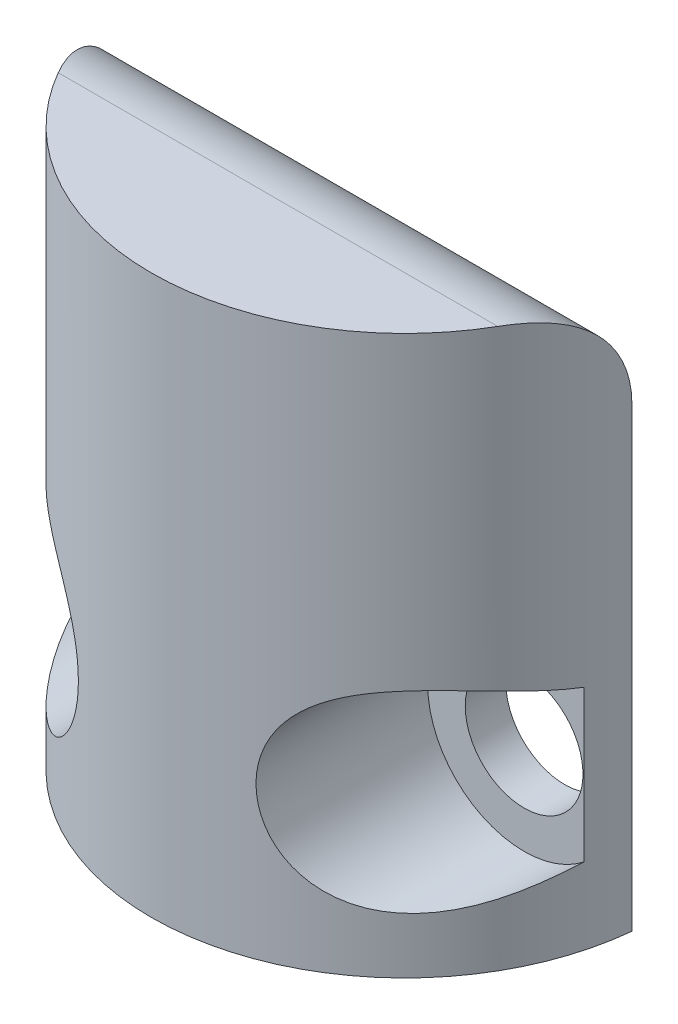
ISO-10303-21;
HEADER;
FILE_DESCRIPTION(('STEP AP214'),'2;1');
FILE_NAME('part.step','',(''),(''),'','','');
FILE_SCHEMA(('AUTOMOTIVE_DESIGN { 1 0 10303 214 1 1 1 1 }'));
ENDSEC;
DATA;
#1=APPLICATION_CONTEXT('core data for automotive mechanical design processes');
#2=APPLICATION_PROTOCOL_DEFINITION('international standard','automotive_design',2000,#1);
#3=PRODUCT_CONTEXT('',#1,'mechanical');
#4=PRODUCT('Part','Part','',(#3));
#5=PRODUCT_RELATED_PRODUCT_CATEGORY('part','',(#4));
#6=PRODUCT_DEFINITION_FORMATION('','',#4);
#7=PRODUCT_DEFINITION_CONTEXT('part definition',#1,'design');
#8=PRODUCT_DEFINITION('design','',#6,#7);
#9=PRODUCT_DEFINITION_SHAPE('','',#8);
#10=(LENGTH_UNIT() NAMED_UNIT(*) SI_UNIT(.MILLI.,.METRE.));
#11=(NAMED_UNIT(*) PLANE_ANGLE_UNIT() SI_UNIT($,.RADIAN.));
#12=(NAMED_UNIT(*) SI_UNIT($,.STERADIAN.) SOLID_ANGLE_UNIT());
#13=UNCERTAINTY_MEASURE_WITH_UNIT(LENGTH_MEASURE(1.E-05),#10,'distance_accuracy_value','');
#14=(GEOMETRIC_REPRESENTATION_CONTEXT(3) GLOBAL_UNCERTAINTY_ASSIGNED_CONTEXT((#13)) GLOBAL_UNIT_ASSIGNED_CONTEXT((#10,
#11,#12)) REPRESENTATION_CONTEXT('',''));
#15=CARTESIAN_POINT('',(0.,0.,0.));
#16=DIRECTION('',(0.,0.,1.));
#17=DIRECTION('',(1.,0.,0.));
#18=AXIS2_PLACEMENT_3D('',#15,#16,#17);
#19=CARTESIAN_POINT('',(0.,1.27,0.));
#20=DIRECTION('',(0.,-1.,0.));
#21=DIRECTION('',(0.,0.,-1.));
#22=AXIS2_PLACEMENT_3D('',#19,#20,#21);
#23=CYLINDRICAL_SURFACE('',#22,6.35);
#24=DIRECTION('',(0.,-1.,0.));
#25=VECTOR('',#24,1.);
#26=CARTESIAN_POINT('',(6.13161471392324,1.27,1.651));
#27=LINE('',#26,#25);
#28=CARTESIAN_POINT('',(6.13161471392324,-10.7832009303775,1.651));
#29=VERTEX_POINT('',#28);
#30=CARTESIAN_POINT('',(6.13161471392324,-6.99679906962246,1.651));
#31=VERTEX_POINT('',#30);
#32=EDGE_CURVE('E183',#29,#31,#27,.F.);
#33=ORIENTED_EDGE('',*,*,#32,.F.);
#34=CARTESIAN_POINT('',(6.13161471392324,-10.7832009303775,1.651));
#35=CARTESIAN_POINT('',(6.08465696292267,-10.8203372092907,1.82524408010255));
#36=CARTESIAN_POINT('',(6.03050997376315,-10.8602679103416,1.99689650970423));
#37=CARTESIAN_POINT('',(5.90784051352878,-10.9416119060905,2.33505320690604));
#38=CARTESIAN_POINT('',(5.83928842423069,-10.9830281073128,2.50154604379));
#39=CARTESIAN_POINT('',(5.68702055717028,-11.0635699656268,2.83082731543768));
#40=CARTESIAN_POINT('',(5.60311854327295,-11.1026586716354,2.99353903880474));
#41=CARTESIAN_POINT('',(5.42089611634268,-11.1736971442452,3.3121013597616));
#42=CARTESIAN_POINT('',(5.32259324440639,-11.2056554782395,3.46796000869843));
#43=CARTESIAN_POINT('',(5.09705877402021,-11.2616792393035,3.79299740181736));
#44=CARTESIAN_POINT('',(4.96770595377609,-11.2840358448012,3.96102658424538));
#45=CARTESIAN_POINT('',(4.69232277558009,-11.3062586692692,4.28359877327395));
#46=CARTESIAN_POINT('',(4.54636973762161,-11.3062252070395,4.43819883121283));
#47=CARTESIAN_POINT('',(4.27195971920654,-11.2785975424492,4.70121291922772));
#48=CARTESIAN_POINT('',(4.14588959293841,-11.2565490273376,4.81266166120411));
#49=CARTESIAN_POINT('',(3.88913196478433,-11.1884947419108,5.02239953506856));
#50=CARTESIAN_POINT('',(3.7584476141943,-11.1425050381734,5.1206974367511));
#51=CARTESIAN_POINT('',(3.52071577881404,-11.0333398417141,5.28624612254147));
#52=CARTESIAN_POINT('',(3.41342510997003,-10.9744123598844,5.35593430018937));
#53=CARTESIAN_POINT('',(3.20449564038788,-10.8368959308363,5.48349026807667));
#54=CARTESIAN_POINT('',(3.10285445770515,-10.7583153478323,5.54136306787053));
#55=CARTESIAN_POINT('',(2.90989311483558,-10.5817502943748,5.64509603090388));
#56=CARTESIAN_POINT('',(2.8186195765344,-10.4836832345985,5.69090306510827));
#57=CARTESIAN_POINT('',(2.65188822242055,-10.2706292963781,5.7704905855411));
#58=CARTESIAN_POINT('',(2.57642912727865,-10.155643787855,5.80427204474811));
#59=CARTESIAN_POINT('',(2.4505738705231,-9.92193735328656,5.85845784129009));
#60=CARTESIAN_POINT('',(2.39867685052603,-9.80421561881349,5.87970314536744));
#61=CARTESIAN_POINT('',(2.31406872354246,-9.56090033628144,5.91351648127844));
#62=CARTESIAN_POINT('',(2.2813546072585,-9.435308026334,5.9260858741912));
#63=CARTESIAN_POINT('',(2.23695652604215,-9.18268462960101,5.94298589256799));
#64=CARTESIAN_POINT('',(2.2248428857175,-9.05573998884292,5.94748495766123));
#65=CARTESIAN_POINT('',(2.22077500579655,-8.80148375915113,5.94900534751648));
#66=CARTESIAN_POINT('',(2.22882016859679,-8.67417218120698,5.94602689394794));
#67=CARTESIAN_POINT('',(2.26475051561729,-8.42285993018447,5.93243354972118));
#68=CARTESIAN_POINT('',(2.29262625879524,-8.29885771070537,5.9218222928995));
#69=CARTESIAN_POINT('',(2.36709445576711,-8.05763276974694,5.8924488606938));
#70=CARTESIAN_POINT('',(2.4136856010671,-7.94040957496504,5.87368725513681));
#71=CARTESIAN_POINT('',(2.52363191724967,-7.71603864818971,5.82729115390978));
#72=CARTESIAN_POINT('',(2.58698468215872,-7.60888947315449,5.79965793155583));
#73=CARTESIAN_POINT('',(2.72767782656088,-7.40747711140313,5.73482785768389));
#74=CARTESIAN_POINT('',(2.80501702234479,-7.31321283538789,5.69763181538081));
#75=CARTESIAN_POINT('',(2.97122847915041,-7.13857907414211,5.61276112865484));
#76=CARTESIAN_POINT('',(3.06022723505682,-7.05838862447448,5.56496685484792));
#77=CARTESIAN_POINT('',(3.24510598953764,-6.91436872559657,5.45922349889674));
#78=CARTESIAN_POINT('',(3.34098722937893,-6.85054223719006,5.40127258225523));
#79=CARTESIAN_POINT('',(3.54208855616838,-6.73563530107442,5.2717458045044));
#80=CARTESIAN_POINT('',(3.64751279157799,-6.68563774860842,5.19953362348372));
#81=CARTESIAN_POINT('',(3.85797336718289,-6.60289958274786,5.04535180954885));
#82=CARTESIAN_POINT('',(3.96300947170836,-6.57016814591338,4.96337701633228));
#83=CARTESIAN_POINT('',(4.14353329555751,-6.52634675347948,4.81287485472478));
#84=CARTESIAN_POINT('',(4.21977775052374,-6.51187752623123,4.74618736263503));
#85=CARTESIAN_POINT('',(4.36955923962279,-6.49050679831617,4.6086664621188));
#86=CARTESIAN_POINT('',(4.44309516260711,-6.48360837080112,4.53783138237688));
#87=CARTESIAN_POINT('',(4.65889022220784,-6.47281112375994,4.31960851131404));
#88=CARTESIAN_POINT('',(4.79613271549078,-6.47885399954297,4.1666726481503));
#89=CARTESIAN_POINT('',(5.02073651376534,-6.5060003963926,3.89073198991577));
#90=CARTESIAN_POINT('',(5.11182472624296,-6.52280994170981,3.77020143075632));
#91=CARTESIAN_POINT('',(5.28468359733588,-6.56426911202905,3.52381081511876));
#92=CARTESIAN_POINT('',(5.36644885750216,-6.58892324843317,3.39794772811378));
#93=CARTESIAN_POINT('',(5.52047983412565,-6.64365435257957,3.14153113017679));
#94=CARTESIAN_POINT('',(5.59273521060381,-6.67373713995497,3.01097270719764));
#95=CARTESIAN_POINT('',(5.72759728707937,-6.73699377723564,2.7457687451254));
#96=CARTESIAN_POINT('',(5.79020753766169,-6.77016648242272,2.611124731982));
#97=CARTESIAN_POINT('',(5.90468051569257,-6.83669985024577,2.34060233084139));
#98=CARTESIAN_POINT('',(5.95672713482786,-6.87004456646148,2.20479775487346));
#99=CARTESIAN_POINT('',(6.05125638615921,-6.93513504104873,1.93021526143747));
#100=CARTESIAN_POINT('',(6.09377910478681,-6.9668870474008,1.79145260568324));
#101=CARTESIAN_POINT('',(6.13161471392324,-6.99679906962246,1.651));
#102=B_SPLINE_CURVE_WITH_KNOTS('',3,(#34,#35,#36,#37,#38,#39,#40,#41,#42,#43,#44,#45,#46,#47,
#48,#49,#50,#51,#52,#53,#54,#55,#56,#57,#58,#59,#60,#61,#62,#63,#64,#65,#66,#67,#68,#69,#70,#71,
#72,#73,#74,#75,#76,#77,#78,#79,#80,#81,#82,#83,#84,#85,#86,#87,#88,#89,#90,#91,#92,#93,#94,#95,
#96,#97,#98,#99,#100,#101),.UNSPECIFIED.,.F.,.F.,(4,2,2,2,2,2,2,2,2,2,2,2,2,2,2,2,2,2,2,2,2,2,2,
2,2,2,2,2,2,2,2,2,2,4),(0.,0.552482548457462,1.10611236631593,1.66696807131099,2.22714621522914,
2.86499669254423,3.49998929712661,4.0072418450712,4.51415442132443,4.93493318785258,
5.35553317788474,5.77795534956817,6.20034333567783,6.58962445888374,6.97884449768145,
7.35984201295284,7.74082823376694,8.12163319402922,8.50241153481148,8.88313524805403,
9.26382675469244,9.64905648107823,10.034355859668,10.4444195955741,10.8547010522993,
11.1612552490851,11.467933836893,12.0820873268028,12.5375834506868,12.9933420040083,
13.4495920747905,13.9056737863644,14.3529648244433,14.7983362579525),.UNSPECIFIED.);
#103=EDGE_CURVE('E50',#29,#31,#102,.T.);
#104=ORIENTED_EDGE('',*,*,#103,.T.);
#105=EDGE_LOOP('',(#33,#104));
#106=FACE_BOUND('',#105,.T.);
#107=DIRECTION('',(0.,-1.,0.));
#108=VECTOR('',#107,1.);
#109=CARTESIAN_POINT('',(6.31817022562704,1.27,0.635));
#110=LINE('',#109,#108);
#111=CARTESIAN_POINT('',(6.31817022562704,-1.27,0.635));
#112=VERTEX_POINT('',#111);
#113=CARTESIAN_POINT('',(6.31817022562704,-12.7,0.635));
#114=VERTEX_POINT('',#113);
#115=EDGE_CURVE('E162',#112,#114,#110,.T.);
#116=ORIENTED_EDGE('',*,*,#115,.F.);
#117=CARTESIAN_POINT('',(6.31817022562704,-1.27,0.635));
#118=CARTESIAN_POINT('',(6.31816213465551,-1.1992432066637,0.634993103996943));
#119=CARTESIAN_POINT('',(6.31787284549376,-1.12848927096166,0.637956595567391));
#120=CARTESIAN_POINT('',(6.31667332253668,-0.987481066100766,0.649771301391292));
#121=CARTESIAN_POINT('',(6.31576309868674,-0.917226788957181,0.658622421343711));
#122=CARTESIAN_POINT('',(6.31326350613699,-0.777728782823313,0.68215609075237));
#123=CARTESIAN_POINT('',(6.31167432470761,-0.708484780620704,0.696837032145452));
#124=CARTESIAN_POINT('',(6.30770332879801,-0.571502021635812,0.73190634568608));
#125=CARTESIAN_POINT('',(6.305321528853,-0.503763237274785,0.752294613170233));
#126=CARTESIAN_POINT('',(6.29676691597175,-0.303431452119897,0.821856145062583));
#127=CARTESIAN_POINT('',(6.28918453090353,-0.173696930261072,0.879430567494685));
#128=CARTESIAN_POINT('',(6.2687140739029,0.0739926035038513,1.01508326199739));
#129=CARTESIAN_POINT('',(6.25582744858638,0.191950816251108,1.09315594151455));
#130=CARTESIAN_POINT('',(6.22306162554342,0.411687416460578,1.2663627895557));
#131=CARTESIAN_POINT('',(6.20325018147308,0.513609176920733,1.36132741479937));
#132=CARTESIAN_POINT('',(6.15493288844206,0.699670867381586,1.56532788801136));
#133=CARTESIAN_POINT('',(6.12643146205448,0.783819805675464,1.67435656214905));
#134=CARTESIAN_POINT('',(6.06017165885335,0.930912029696587,1.90009592462027));
#135=CARTESIAN_POINT('',(6.0226064965564,0.99424004996232,2.01661320493012));
#136=CARTESIAN_POINT('',(5.93744950044908,1.10115570756565,2.25504461676565));
#137=CARTESIAN_POINT('',(5.88984672218053,1.14472163267309,2.37696452345884));
#138=CARTESIAN_POINT('',(5.78877505207432,1.20984957430456,2.61301421922237));
#139=CARTESIAN_POINT('',(5.73599027193432,1.23278840808031,2.72706124687398));
#140=CARTESIAN_POINT('',(5.65121035022969,1.25534127515703,2.89660585776617));
#141=CARTESIAN_POINT('',(5.6220463213732,1.26088333867412,2.95281480630573));
#142=CARTESIAN_POINT('',(5.56195350236283,1.26821169516376,3.0645058550167));
#143=CARTESIAN_POINT('',(5.53102534653192,1.26999932947192,3.11998820773468));
#144=CARTESIAN_POINT('',(5.49926131403119,1.27,3.175));
#145=B_SPLINE_CURVE_WITH_KNOTS('',3,(#117,#118,#119,#120,#121,#122,#123,#124,#125,#126,#127,
#128,#129,#130,#131,#132,#133,#134,#135,#136,#137,#138,#139,#140,#141,#142,#143,#144),
.UNSPECIFIED.,.F.,.F.,(4,2,2,2,2,2,2,2,2,2,2,2,2,4),(0.,0.212202505805552,0.424401612885381,
0.636542228841824,0.848678954727564,1.27287401322298,1.69695345833858,2.11699470350588,
2.53682253384688,2.94838819045532,3.36040493751236,3.74227345320946,3.93285333693207,
4.12336512106239),.UNSPECIFIED.);
#146=CARTESIAN_POINT('',(5.49926131403119,1.27,3.175));
#147=VERTEX_POINT('',#146);
#148=EDGE_CURVE('E122',#112,#147,#145,.T.);
#149=ORIENTED_EDGE('',*,*,#148,.T.);
#150=CARTESIAN_POINT('',(0.,1.27,0.));
#151=DIRECTION('',(0.,-1.,0.));
#152=DIRECTION('',(0.,0.,-1.));
#153=AXIS2_PLACEMENT_3D('',#150,#151,#152);
#154=CIRCLE('',#153,6.35);
#155=CARTESIAN_POINT('',(-5.49926131403119,1.27,3.175));
#156=VERTEX_POINT('',#155);
#157=EDGE_CURVE('E159',#147,#156,#154,.T.);
#158=ORIENTED_EDGE('',*,*,#157,.T.);
#159=CARTESIAN_POINT('',(-5.49926131403119,1.27,3.175));
#160=CARTESIAN_POINT('',(-5.53672702267652,1.27000551953054,3.11012790358959));
#161=CARTESIAN_POINT('',(-5.57303629384351,1.26751405844095,3.0445668314749));
#162=CARTESIAN_POINT('',(-5.64317998425625,1.25726564480609,2.91248716880679));
#163=CARTESIAN_POINT('',(-5.67701277607268,1.24950526357727,2.84596798237807));
#164=CARTESIAN_POINT('',(-5.74207093839374,1.22842126657922,2.71231657017477));
#165=CARTESIAN_POINT('',(-5.7732897945984,1.21508422086392,2.64518324975682));
#166=CARTESIAN_POINT('',(-5.83287187191984,1.18266662952606,2.51107618554955));
#167=CARTESIAN_POINT('',(-5.86123572587105,1.16358736047159,2.44410240962353));
#168=CARTESIAN_POINT('',(-5.9421222191991,1.09730411344959,2.24373948339701));
#169=CARTESIAN_POINT('',(-5.99021965474208,1.04112298182265,2.11136555720538));
#170=CARTESIAN_POINT('',(-6.07434739218528,0.905210716645366,1.85552513560956));
#171=CARTESIAN_POINT('',(-6.11040008296635,0.825523801134444,1.73204245220025));
#172=CARTESIAN_POINT('',(-6.1693944038546,0.651138459608564,1.50782206664462));
#173=CARTESIAN_POINT('',(-6.1931109052655,0.557994427164414,1.40607624026618));
#174=CARTESIAN_POINT('',(-6.23276646980775,0.355473556340831,1.21834207465354));
#175=CARTESIAN_POINT('',(-6.2487011545758,0.246087624642054,1.13236262316588));
#176=CARTESIAN_POINT('',(-6.27437499285584,0.0156638974982776,0.980115584791894));
#177=CARTESIAN_POINT('',(-6.28418659676041,-0.10521734430699,0.913622626576287));
#178=CARTESIAN_POINT('',(-6.29953219300867,-0.356340526032873,0.801026435365366));
#179=CARTESIAN_POINT('',(-6.30506762272937,-0.486579304443084,0.754916353178521));
#180=CARTESIAN_POINT('',(-6.31228960320706,-0.725697585164578,0.69158143653377));
#181=CARTESIAN_POINT('',(-6.31453059602546,-0.833521679091525,0.670385252317526));
#182=CARTESIAN_POINT('',(-6.31673383343168,-0.996546770669514,0.649167806277558));
#183=CARTESIAN_POINT('',(-6.31727521213335,-1.0510911353874,0.643858135019645));
#184=CARTESIAN_POINT('',(-6.31799219170653,-1.1604193516346,0.636773596651456));
#185=CARTESIAN_POINT('',(-6.3181677391853,-1.21520323695267,0.634999245519861));
#186=CARTESIAN_POINT('',(-6.31817022562704,-1.27,0.635));
#187=B_SPLINE_CURVE_WITH_KNOTS('',3,(#159,#160,#161,#162,#163,#164,#165,#166,#167,#168,#169,
#170,#171,#172,#173,#174,#175,#176,#177,#178,#179,#180,#181,#182,#183,#184,#185,#186),
.UNSPECIFIED.,.F.,.F.,(4,2,2,2,2,2,2,2,2,2,2,2,2,4),(0.,0.224713653604304,0.449573677124746,
0.674978365136957,0.900332979835099,1.3525565326243,1.8039347494822,2.22179023196271,
2.63988054666961,3.05292510318653,3.46583075998286,3.79459881607848,3.95891046664843,
4.12324609668751),.UNSPECIFIED.);
#188=CARTESIAN_POINT('',(-6.31817022562704,-1.27,0.635));
#189=VERTEX_POINT('',#188);
#190=EDGE_CURVE('E114',#156,#189,#187,.T.);
#191=ORIENTED_EDGE('',*,*,#190,.T.);
#192=DIRECTION('',(0.,-1.,0.));
#193=VECTOR('',#192,1.);
#194=CARTESIAN_POINT('',(-6.31817022562704,1.27,0.635));
#195=LINE('',#194,#193);
#196=CARTESIAN_POINT('',(-6.31817022562704,-12.7,0.635));
#197=VERTEX_POINT('',#196);
#198=EDGE_CURVE('E200',#189,#197,#195,.T.);
#199=ORIENTED_EDGE('',*,*,#198,.T.);
#200=CARTESIAN_POINT('',(0.,-12.7,0.));
#201=DIRECTION('',(0.,-1.,0.));
#202=DIRECTION('',(0.,0.,-1.));
#203=AXIS2_PLACEMENT_3D('',#200,#201,#202);
#204=CIRCLE('',#203,6.35);
#205=EDGE_CURVE('E163',#114,#197,#204,.T.);
#206=ORIENTED_EDGE('',*,*,#205,.F.);
#207=EDGE_LOOP('',(#116,#149,#158,#191,#199,#206));
#208=FACE_BOUND('',#207,.T.);
#209=DIRECTION('',(0.,-1.,0.));
#210=VECTOR('',#209,1.);
#211=CARTESIAN_POINT('',(-6.13161471392324,1.27,1.651));
#212=LINE('',#211,#210);
#213=CARTESIAN_POINT('',(-6.13161471392324,-6.99679906962246,1.651));
#214=VERTEX_POINT('',#213);
#215=CARTESIAN_POINT('',(-6.13161471392324,-10.7832009303775,1.651));
#216=VERTEX_POINT('',#215);
#217=EDGE_CURVE('E87',#214,#216,#212,.T.);
#218=ORIENTED_EDGE('',*,*,#217,.F.);
#219=CARTESIAN_POINT('',(-6.13161471392324,-6.99679906962246,1.651));
#220=CARTESIAN_POINT('',(-6.08465696292267,-6.95966279070934,1.82524408010255));
#221=CARTESIAN_POINT('',(-6.03050997376314,-6.9197320896584,1.99689650970423));
#222=CARTESIAN_POINT('',(-5.90784051352878,-6.8383880939095,2.33505320690604));
#223=CARTESIAN_POINT('',(-5.83928842423069,-6.79697189268725,2.50154604379));
#224=CARTESIAN_POINT('',(-5.68702055717028,-6.7164300343732,2.83082731543768));
#225=CARTESIAN_POINT('',(-5.60311854327295,-6.67734132836457,2.99353903880474));
#226=CARTESIAN_POINT('',(-5.42089611634268,-6.60630285575485,3.31210135976159));
#227=CARTESIAN_POINT('',(-5.32259324440639,-6.57434452176051,3.46796000869843));
#228=CARTESIAN_POINT('',(-5.09705877402021,-6.5183207606965,3.79299740181736));
#229=CARTESIAN_POINT('',(-4.96770595377609,-6.49596415519877,3.96102658424538));
#230=CARTESIAN_POINT('',(-4.69232277558009,-6.47374133073077,4.28359877327395));
#231=CARTESIAN_POINT('',(-4.54636973762161,-6.47377479296053,4.43819883121283));
#232=CARTESIAN_POINT('',(-4.27195971920654,-6.50140245755078,4.70121291922772));
#233=CARTESIAN_POINT('',(-4.14588959293841,-6.52345097266238,4.81266166120411));
#234=CARTESIAN_POINT('',(-3.88913196478433,-6.59150525808915,5.02239953506856));
#235=CARTESIAN_POINT('',(-3.7584476141943,-6.63749496182663,5.1206974367511));
#236=CARTESIAN_POINT('',(-3.52071577881404,-6.74666015828593,5.28624612254147));
#237=CARTESIAN_POINT('',(-3.41342510997003,-6.80558764011557,5.35593430018937));
#238=CARTESIAN_POINT('',(-3.20449564038788,-6.94310406916368,5.48349026807667));
#239=CARTESIAN_POINT('',(-3.10285445770515,-7.02168465216771,5.54136306787053));
#240=CARTESIAN_POINT('',(-2.90989311483558,-7.19824970562522,5.64509603090388));
#241=CARTESIAN_POINT('',(-2.81861957653439,-7.29631676540147,5.69090306510827));
#242=CARTESIAN_POINT('',(-2.65188822242055,-7.50937070362188,5.7704905855411));
#243=CARTESIAN_POINT('',(-2.57642912727865,-7.62435621214502,5.80427204474811));
#244=CARTESIAN_POINT('',(-2.4505738705231,-7.85806264671344,5.85845784129009));
#245=CARTESIAN_POINT('',(-2.39867685052602,-7.97578438118651,5.87970314536744));
#246=CARTESIAN_POINT('',(-2.31406872354246,-8.21909966371856,5.91351648127845));
#247=CARTESIAN_POINT('',(-2.2813546072585,-8.344691973666,5.9260858741912));
#248=CARTESIAN_POINT('',(-2.23695652604215,-8.59731537039898,5.94298589256799));
#249=CARTESIAN_POINT('',(-2.22484288571749,-8.72426001115708,5.94748495766123));
#250=CARTESIAN_POINT('',(-2.22077500579655,-8.97851624084887,5.94900534751648));
#251=CARTESIAN_POINT('',(-2.22882016859679,-9.10582781879302,5.94602689394794));
#252=CARTESIAN_POINT('',(-2.26475051561729,-9.35714006981553,5.93243354972118));
#253=CARTESIAN_POINT('',(-2.29262625879524,-9.48114228929463,5.9218222928995));
#254=CARTESIAN_POINT('',(-2.36709445576711,-9.72236723025306,5.8924488606938));
#255=CARTESIAN_POINT('',(-2.4136856010671,-9.83959042503496,5.87368725513681));
#256=CARTESIAN_POINT('',(-2.52363191724967,-10.0639613518103,5.82729115390978));
#257=CARTESIAN_POINT('',(-2.58698468215872,-10.1711105268455,5.79965793155583));
#258=CARTESIAN_POINT('',(-2.72767782656088,-10.3725228885969,5.73482785768389));
#259=CARTESIAN_POINT('',(-2.80501702234479,-10.4667871646121,5.69763181538081));
#260=CARTESIAN_POINT('',(-2.97122847915041,-10.6414209258579,5.61276112865484));
#261=CARTESIAN_POINT('',(-3.06022723505682,-10.7216113755255,5.56496685484792));
#262=CARTESIAN_POINT('',(-3.24510598953764,-10.8656312744034,5.45922349889675));
#263=CARTESIAN_POINT('',(-3.34098722937893,-10.9294577628099,5.40127258225523));
#264=CARTESIAN_POINT('',(-3.54208855616837,-11.0443646989256,5.2717458045044));
#265=CARTESIAN_POINT('',(-3.64751279157799,-11.0943622513916,5.19953362348373));
#266=CARTESIAN_POINT('',(-3.85797336718289,-11.1771004172521,5.04535180954885));
#267=CARTESIAN_POINT('',(-3.96300947170835,-11.2098318540866,4.96337701633228));
#268=CARTESIAN_POINT('',(-4.14353329555751,-11.2536532465205,4.81287485472478));
#269=CARTESIAN_POINT('',(-4.21977775052374,-11.2681224737688,4.74618736263503));
#270=CARTESIAN_POINT('',(-4.36955923962279,-11.2894932016838,4.6086664621188));
#271=CARTESIAN_POINT('',(-4.44309516260711,-11.2963916291989,4.53783138237688));
#272=CARTESIAN_POINT('',(-4.65889022220784,-11.3071888762401,4.31960851131404));
#273=CARTESIAN_POINT('',(-4.79613271549078,-11.301146000457,4.1666726481503));
#274=CARTESIAN_POINT('',(-5.02073651376534,-11.2739996036074,3.89073198991577));
#275=CARTESIAN_POINT('',(-5.11182472624296,-11.2571900582902,3.77020143075633));
#276=CARTESIAN_POINT('',(-5.28468359733587,-11.2157308879709,3.52381081511877));
#277=CARTESIAN_POINT('',(-5.36644885750216,-11.1910767515668,3.39794772811378));
#278=CARTESIAN_POINT('',(-5.52047983412565,-11.1363456474204,3.14153113017679));
#279=CARTESIAN_POINT('',(-5.59273521060381,-11.106262860045,3.01097270719764));
#280=CARTESIAN_POINT('',(-5.72759728707937,-11.0430062227644,2.7457687451254));
#281=CARTESIAN_POINT('',(-5.79020753766169,-11.0098335175773,2.611124731982));
#282=CARTESIAN_POINT('',(-5.90468051569257,-10.9433001497542,2.34060233084139));
#283=CARTESIAN_POINT('',(-5.95672713482786,-10.9099554335385,2.20479775487346));
#284=CARTESIAN_POINT('',(-6.05125638615921,-10.8448649589513,1.93021526143747));
#285=CARTESIAN_POINT('',(-6.09377910478681,-10.8131129525992,1.79145260568324));
#286=CARTESIAN_POINT('',(-6.13161471392324,-10.7832009303775,1.651));
#287=B_SPLINE_CURVE_WITH_KNOTS('',3,(#219,#220,#221,#222,#223,#224,#225,#226,#227,#228,#229,
#230,#231,#232,#233,#234,#235,#236,#237,#238,#239,#240,#241,#242,#243,#244,#245,#246,#247,#248,
#249,#250,#251,#252,#253,#254,#255,#256,#257,#258,#259,#260,#261,#262,#263,#264,#265,#266,#267,
#268,#269,#270,#271,#272,#273,#274,#275,#276,#277,#278,#279,#280,#281,#282,#283,#284,#285,#286),
.UNSPECIFIED.,.F.,.F.,(4,2,2,2,2,2,2,2,2,2,2,2,2,2,2,2,2,2,2,2,2,2,2,2,2,2,2,2,2,2,2,2,2,4),(0.,
0.552482548457463,1.10611236631593,1.66696807131099,2.22714621522914,2.86499669254423,
3.49998929712661,4.0072418450712,4.51415442132443,4.93493318785258,5.35553317788474,
5.77795534956817,6.20034333567783,6.58962445888374,6.97884449768145,7.35984201295284,
7.74082823376694,8.12163319402922,8.50241153481148,8.88313524805403,9.26382675469243,
9.64905648107823,10.034355859668,10.4444195955741,10.8547010522993,11.1612552490851,
11.467933836893,12.0820873268027,12.5375834506868,12.9933420040083,13.4495920747904,
13.9056737863644,14.3529648244433,14.7983362579525),.UNSPECIFIED.);
#288=EDGE_CURVE('E11',#214,#216,#287,.T.);
#289=ORIENTED_EDGE('',*,*,#288,.T.);
#290=EDGE_LOOP('',(#218,#289));
#291=FACE_BOUND('',#290,.T.);
#292=ADVANCED_FACE('F35',(#106,#208,#291),#23,.T.);
#293=CARTESIAN_POINT('',(0.,1.27,0.635));
#294=DIRECTION('',(0.,0.,-1.));
#295=DIRECTION('',(-1.,0.,0.));
#296=AXIS2_PLACEMENT_3D('',#293,#294,#295);
#297=PLANE('',#296);
#298=CARTESIAN_POINT('',(-4.6355,-8.89,0.635));
#299=DIRECTION('',(0.,0.,-1.));
#300=DIRECTION('',(-1.,0.,0.));
#301=AXIS2_PLACEMENT_3D('',#298,#299,#300);
#302=CIRCLE('',#301,1.4732);
#303=CARTESIAN_POINT('',(-6.1087,-8.89,0.635));
#304=VERTEX_POINT('',#303);
#305=EDGE_CURVE('E189',#304,#304,#302,.T.);
#306=ORIENTED_EDGE('',*,*,#305,.F.);
#307=EDGE_LOOP('',(#306));
#308=FACE_BOUND('',#307,.T.);
#309=CARTESIAN_POINT('',(4.6355,-8.89,0.635));
#310=DIRECTION('',(0.,0.,-1.));
#311=DIRECTION('',(-1.,0.,0.));
#312=AXIS2_PLACEMENT_3D('',#309,#310,#311);
#313=CIRCLE('',#312,1.4732);
#314=CARTESIAN_POINT('',(3.1623,-8.89,0.635));
#315=VERTEX_POINT('',#314);
#316=EDGE_CURVE('E186',#315,#315,#313,.T.);
#317=ORIENTED_EDGE('',*,*,#316,.F.);
#318=EDGE_LOOP('',(#317));
#319=FACE_BOUND('',#318,.T.);
#320=ORIENTED_EDGE('',*,*,#198,.F.);
#321=DIRECTION('',(1.,0.,0.));
#322=VECTOR('',#321,1.);
#323=CARTESIAN_POINT('',(6.31817022562704,-1.27,0.635));
#324=LINE('',#323,#322);
#325=EDGE_CURVE('E202',#189,#112,#324,.T.);
#326=ORIENTED_EDGE('',*,*,#325,.T.);
#327=ORIENTED_EDGE('',*,*,#115,.T.);
#328=DIRECTION('',(1.,0.,0.));
#329=VECTOR('',#328,1.);
#330=CARTESIAN_POINT('',(0.,-12.7,0.635));
#331=LINE('',#330,#329);
#332=EDGE_CURVE('E194',#197,#114,#331,.T.);
#333=ORIENTED_EDGE('',*,*,#332,.F.);
#334=EDGE_LOOP('',(#320,#326,#327,#333));
#335=FACE_BOUND('',#334,.T.);
#336=ADVANCED_FACE('F98',(#308,#319,#335),#297,.T.);
#337=CARTESIAN_POINT('',(0.,1.27,0.));
#338=DIRECTION('',(0.,-1.,0.));
#339=DIRECTION('',(0.,0.,-1.));
#340=AXIS2_PLACEMENT_3D('',#337,#338,#339);
#341=PLANE('',#340);
#342=ORIENTED_EDGE('',*,*,#157,.F.);
#343=DIRECTION('',(1.,0.,0.));
#344=VECTOR('',#343,1.);
#345=CARTESIAN_POINT('',(-6.31817022562704,1.27,3.175));
#346=LINE('',#345,#344);
#347=EDGE_CURVE('E135',#147,#156,#346,.F.);
#348=ORIENTED_EDGE('',*,*,#347,.T.);
#349=EDGE_LOOP('',(#342,#348));
#350=FACE_BOUND('',#349,.T.);
#351=ADVANCED_FACE('F103',(#350),#341,.F.);
#352=CARTESIAN_POINT('',(0.,-12.7,0.));
#353=DIRECTION('',(0.,-1.,0.));
#354=DIRECTION('',(0.,0.,-1.));
#355=AXIS2_PLACEMENT_3D('',#352,#353,#354);
#356=PLANE('',#355);
#357=ORIENTED_EDGE('',*,*,#332,.T.);
#358=ORIENTED_EDGE('',*,*,#205,.T.);
#359=EDGE_LOOP('',(#357,#358));
#360=FACE_BOUND('',#359,.T.);
#361=ADVANCED_FACE('F109',(#360),#356,.T.);
#362=CARTESIAN_POINT('',(0.,-1.27,3.175));
#363=DIRECTION('',(-1.,0.,0.));
#364=DIRECTION('',(0.,0.,1.));
#365=AXIS2_PLACEMENT_3D('',#362,#363,#364);
#366=CYLINDRICAL_SURFACE('',#365,2.54);
#367=ORIENTED_EDGE('',*,*,#190,.F.);
#368=ORIENTED_EDGE('',*,*,#347,.F.);
#369=ORIENTED_EDGE('',*,*,#148,.F.);
#370=ORIENTED_EDGE('',*,*,#325,.F.);
#371=EDGE_LOOP('',(#367,#368,#369,#370));
#372=FACE_BOUND('',#371,.T.);
#373=ADVANCED_FACE('F37',(#372),#366,.T.);
#374=CARTESIAN_POINT('',(4.6355,-8.89,6.35));
#375=DIRECTION('',(0.,0.,-1.));
#376=DIRECTION('',(-1.,0.,0.));
#377=AXIS2_PLACEMENT_3D('',#374,#375,#376);
#378=CYLINDRICAL_SURFACE('',#377,1.4732);
#379=CARTESIAN_POINT('',(4.6355,-8.89,1.651));
#380=DIRECTION('',(0.,0.,-1.));
#381=DIRECTION('',(-1.,0.,0.));
#382=AXIS2_PLACEMENT_3D('',#379,#380,#381);
#383=CIRCLE('',#382,1.4732);
#384=CARTESIAN_POINT('',(3.1623,-8.89,1.651));
#385=VERTEX_POINT('',#384);
#386=EDGE_CURVE('E91',#385,#385,#383,.F.);
#387=ORIENTED_EDGE('',*,*,#386,.T.);
#388=EDGE_LOOP('',(#387));
#389=FACE_BOUND('',#388,.T.);
#390=ORIENTED_EDGE('',*,*,#316,.T.);
#391=EDGE_LOOP('',(#390));
#392=FACE_BOUND('',#391,.T.);
#393=ADVANCED_FACE('F147',(#389,#392),#378,.F.);
#394=CARTESIAN_POINT('',(-4.6355,-8.89,6.35));
#395=DIRECTION('',(0.,0.,-1.));
#396=DIRECTION('',(-1.,0.,0.));
#397=AXIS2_PLACEMENT_3D('',#394,#395,#396);
#398=CYLINDRICAL_SURFACE('',#397,1.4732);
#399=CARTESIAN_POINT('',(-4.6355,-8.89,1.651));
#400=DIRECTION('',(0.,0.,-1.));
#401=DIRECTION('',(-1.,0.,0.));
#402=AXIS2_PLACEMENT_3D('',#399,#400,#401);
#403=CIRCLE('',#402,1.4732);
#404=CARTESIAN_POINT('',(-6.1087,-8.89,1.651));
#405=VERTEX_POINT('',#404);
#406=EDGE_CURVE('E92',#405,#405,#403,.F.);
#407=ORIENTED_EDGE('',*,*,#406,.T.);
#408=EDGE_LOOP('',(#407));
#409=FACE_BOUND('',#408,.T.);
#410=ORIENTED_EDGE('',*,*,#305,.T.);
#411=EDGE_LOOP('',(#410));
#412=FACE_BOUND('',#411,.T.);
#413=ADVANCED_FACE('F144',(#409,#412),#398,.F.);
#414=CARTESIAN_POINT('',(-4.6355,-8.89,1.651));
#415=DIRECTION('',(0.,0.,-1.));
#416=DIRECTION('',(-1.,0.,0.));
#417=AXIS2_PLACEMENT_3D('',#414,#415,#416);
#418=PLANE('',#417);
#419=ORIENTED_EDGE('',*,*,#217,.T.);
#420=CARTESIAN_POINT('',(-4.6355,-8.89,1.651));
#421=DIRECTION('',(0.,0.,-1.));
#422=DIRECTION('',(-1.,0.,0.));
#423=AXIS2_PLACEMENT_3D('',#420,#421,#422);
#424=CIRCLE('',#423,2.413);
#425=EDGE_CURVE('E56',#214,#216,#424,.T.);
#426=ORIENTED_EDGE('',*,*,#425,.F.);
#427=EDGE_LOOP('',(#419,#426));
#428=FACE_BOUND('',#427,.T.);
#429=ORIENTED_EDGE('',*,*,#406,.F.);
#430=EDGE_LOOP('',(#429));
#431=FACE_BOUND('',#430,.T.);
#432=ADVANCED_FACE('F88',(#428,#431),#418,.F.);
#433=CARTESIAN_POINT('',(-4.6355,-8.89,1.651));
#434=DIRECTION('',(0.,0.,1.));
#435=DIRECTION('',(1.,0.,0.));
#436=AXIS2_PLACEMENT_3D('',#433,#434,#435);
#437=CYLINDRICAL_SURFACE('',#436,2.413);
#438=ORIENTED_EDGE('',*,*,#425,.T.);
#439=ORIENTED_EDGE('',*,*,#288,.F.);
#440=EDGE_LOOP('',(#438,#439));
#441=FACE_BOUND('',#440,.T.);
#442=ADVANCED_FACE('F95',(#441),#437,.F.);
#443=CARTESIAN_POINT('',(4.6355,-8.89,1.651));
#444=DIRECTION('',(0.,0.,-1.));
#445=DIRECTION('',(-1.,0.,0.));
#446=AXIS2_PLACEMENT_3D('',#443,#444,#445);
#447=PLANE('',#446);
#448=ORIENTED_EDGE('',*,*,#32,.T.);
#449=CARTESIAN_POINT('',(4.6355,-8.89,1.651));
#450=DIRECTION('',(0.,0.,-1.));
#451=DIRECTION('',(-1.,0.,0.));
#452=AXIS2_PLACEMENT_3D('',#449,#450,#451);
#453=CIRCLE('',#452,2.413);
#454=EDGE_CURVE('E63',#29,#31,#453,.T.);
#455=ORIENTED_EDGE('',*,*,#454,.F.);
#456=EDGE_LOOP('',(#448,#455));
#457=FACE_BOUND('',#456,.T.);
#458=ORIENTED_EDGE('',*,*,#386,.F.);
#459=EDGE_LOOP('',(#458));
#460=FACE_BOUND('',#459,.T.);
#461=ADVANCED_FACE('F142',(#457,#460),#447,.F.);
#462=CARTESIAN_POINT('',(4.6355,-8.89,1.651));
#463=DIRECTION('',(0.,0.,1.));
#464=DIRECTION('',(1.,0.,0.));
#465=AXIS2_PLACEMENT_3D('',#462,#463,#464);
#466=CYLINDRICAL_SURFACE('',#465,2.413);
#467=ORIENTED_EDGE('',*,*,#454,.T.);
#468=ORIENTED_EDGE('',*,*,#103,.F.);
#469=EDGE_LOOP('',(#467,#468));
#470=FACE_BOUND('',#469,.T.);
#471=ADVANCED_FACE('F137',(#470),#466,.F.);
#472=CLOSED_SHELL('',(#292,#336,#351,#361,#373,#393,#413,#432,#442,#461,#471));
#473=MANIFOLD_SOLID_BREP('B2',#472);
#474=ADVANCED_BREP_SHAPE_REPRESENTATION('',(#18,#473),#14);
#475=SHAPE_DEFINITION_REPRESENTATION(#9,#474);
ENDSEC;
END-ISO-10303-21;
